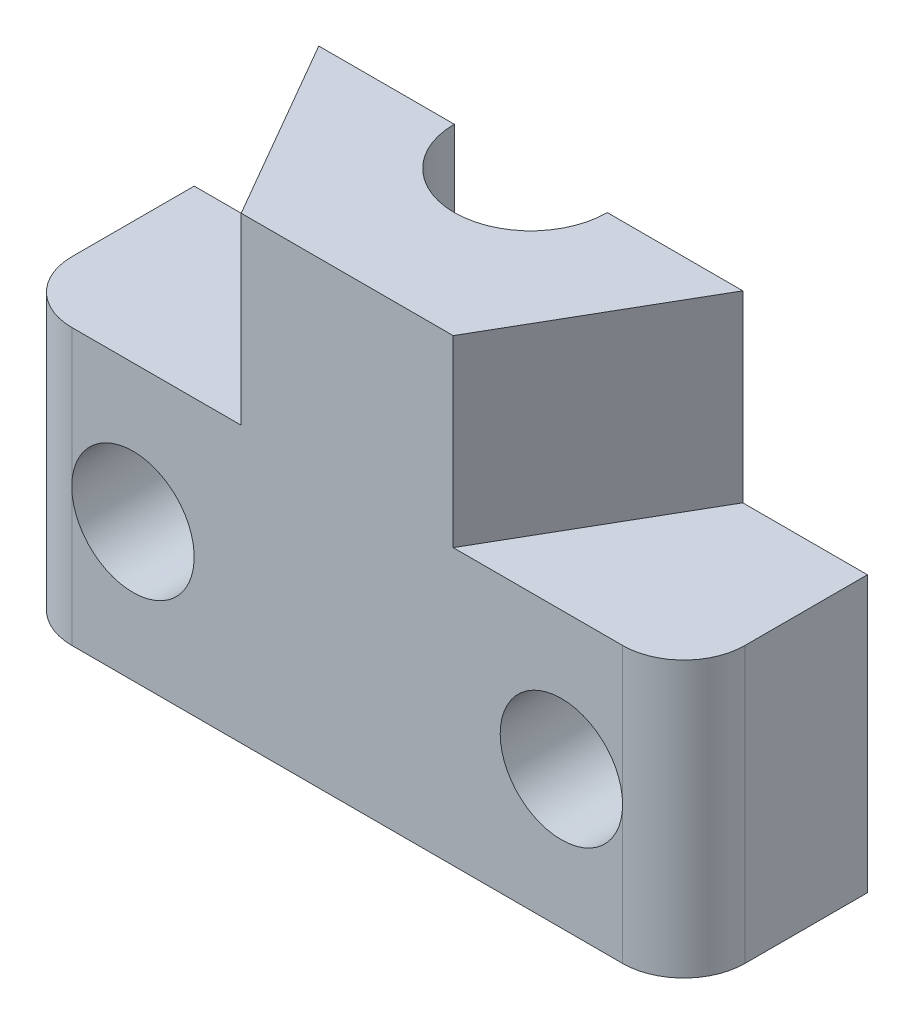
ISO-10303-21;
HEADER;
FILE_DESCRIPTION(('STEP AP214'),'2;1');
FILE_NAME('part.step','',(''),(''),'','','');
FILE_SCHEMA(('AUTOMOTIVE_DESIGN { 1 0 10303 214 1 1 1 1 }'));
ENDSEC;
DATA;
#1=APPLICATION_CONTEXT('core data for automotive mechanical design processes');
#2=APPLICATION_PROTOCOL_DEFINITION('international standard','automotive_design',2000,#1);
#3=PRODUCT_CONTEXT('',#1,'mechanical');
#4=PRODUCT('Part','Part','',(#3));
#5=PRODUCT_RELATED_PRODUCT_CATEGORY('part','',(#4));
#6=PRODUCT_DEFINITION_FORMATION('','',#4);
#7=PRODUCT_DEFINITION_CONTEXT('part definition',#1,'design');
#8=PRODUCT_DEFINITION('design','',#6,#7);
#9=PRODUCT_DEFINITION_SHAPE('','',#8);
#10=(LENGTH_UNIT() NAMED_UNIT(*) SI_UNIT(.MILLI.,.METRE.));
#11=(NAMED_UNIT(*) PLANE_ANGLE_UNIT() SI_UNIT($,.RADIAN.));
#12=(NAMED_UNIT(*) SI_UNIT($,.STERADIAN.) SOLID_ANGLE_UNIT());
#13=UNCERTAINTY_MEASURE_WITH_UNIT(LENGTH_MEASURE(1.E-05),#10,'distance_accuracy_value','');
#14=(GEOMETRIC_REPRESENTATION_CONTEXT(3) GLOBAL_UNCERTAINTY_ASSIGNED_CONTEXT((#13)) GLOBAL_UNIT_ASSIGNED_CONTEXT((#10,
#11,#12)) REPRESENTATION_CONTEXT('',''));
#15=CARTESIAN_POINT('',(0.,0.,0.));
#16=DIRECTION('',(0.,0.,1.));
#17=DIRECTION('',(1.,0.,0.));
#18=AXIS2_PLACEMENT_3D('',#15,#16,#17);
#19=CARTESIAN_POINT('',(0.,15.,0.));
#20=DIRECTION('',(0.,1.,0.));
#21=DIRECTION('',(0.,0.,1.));
#22=AXIS2_PLACEMENT_3D('',#19,#20,#21);
#23=PLANE('',#22);
#24=DIRECTION('',(0.5,0.,-0.866025403784439));
#25=VECTOR('',#24,1.);
#26=CARTESIAN_POINT('',(3.46410161513776,15.,6.00000000000001));
#27=LINE('',#26,#25);
#28=CARTESIAN_POINT('',(3.46410161513776,15.,6.00000000000001));
#29=VERTEX_POINT('',#28);
#30=CARTESIAN_POINT('',(6.92820323027551,15.,0.));
#31=VERTEX_POINT('',#30);
#32=EDGE_CURVE('E219',#29,#31,#27,.T.);
#33=ORIENTED_EDGE('',*,*,#32,.T.);
#34=DIRECTION('',(-1.,0.,0.));
#35=VECTOR('',#34,1.);
#36=CARTESIAN_POINT('',(0.,15.,0.));
#37=LINE('',#36,#35);
#38=CARTESIAN_POINT('',(2.5,15.,0.));
#39=VERTEX_POINT('',#38);
#40=EDGE_CURVE('E398',#31,#39,#37,.T.);
#41=ORIENTED_EDGE('',*,*,#40,.T.);
#42=CARTESIAN_POINT('',(0.,15.,0.));
#43=DIRECTION('',(0.,1.,0.));
#44=DIRECTION('',(0.,0.,1.));
#45=AXIS2_PLACEMENT_3D('',#42,#43,#44);
#46=CIRCLE('',#45,2.5);
#47=CARTESIAN_POINT('',(-2.5,15.,0.));
#48=VERTEX_POINT('',#47);
#49=EDGE_CURVE('E201',#48,#39,#46,.T.);
#50=ORIENTED_EDGE('',*,*,#49,.F.);
#51=CARTESIAN_POINT('',(-6.92820323027552,15.,0.));
#52=VERTEX_POINT('',#51);
#53=EDGE_CURVE('E62',#48,#52,#37,.T.);
#54=ORIENTED_EDGE('',*,*,#53,.T.);
#55=DIRECTION('',(0.5,0.,0.866025403784439));
#56=VECTOR('',#55,1.);
#57=CARTESIAN_POINT('',(-6.92820323027552,15.,0.));
#58=LINE('',#57,#56);
#59=CARTESIAN_POINT('',(-3.46410161513776,15.,6.00000000000001));
#60=VERTEX_POINT('',#59);
#61=EDGE_CURVE('E349',#52,#60,#58,.T.);
#62=ORIENTED_EDGE('',*,*,#61,.T.);
#63=DIRECTION('',(1.,0.,0.));
#64=VECTOR('',#63,1.);
#65=CARTESIAN_POINT('',(-3.46410161513776,15.,6.00000000000001));
#66=LINE('',#65,#64);
#67=EDGE_CURVE('E226',#60,#29,#66,.T.);
#68=ORIENTED_EDGE('',*,*,#67,.T.);
#69=EDGE_LOOP('',(#33,#41,#50,#54,#62,#68));
#70=FACE_BOUND('',#69,.T.);
#71=ADVANCED_FACE('F37',(#70),#23,.T.);
#72=CARTESIAN_POINT('',(0.,12.,0.));
#73=DIRECTION('',(0.,1.,0.));
#74=DIRECTION('',(0.,0.,1.));
#75=AXIS2_PLACEMENT_3D('',#72,#73,#74);
#76=PLANE('',#75);
#77=DIRECTION('',(-1.,0.,0.));
#78=VECTOR('',#77,1.);
#79=CARTESIAN_POINT('',(0.,12.,0.));
#80=LINE('',#79,#78);
#81=CARTESIAN_POINT('',(4.61880215351701,12.,0.));
#82=VERTEX_POINT('',#81);
#83=CARTESIAN_POINT('',(2.5,12.,0.));
#84=VERTEX_POINT('',#83);
#85=EDGE_CURVE('E54',#82,#84,#80,.T.);
#86=ORIENTED_EDGE('',*,*,#85,.F.);
#87=DIRECTION('',(0.5,0.,-0.866025403784439));
#88=VECTOR('',#87,1.);
#89=CARTESIAN_POINT('',(2.3094010767585,12.,4.));
#90=LINE('',#89,#88);
#91=CARTESIAN_POINT('',(2.3094010767585,12.,4.));
#92=VERTEX_POINT('',#91);
#93=EDGE_CURVE('E327',#92,#82,#90,.T.);
#94=ORIENTED_EDGE('',*,*,#93,.F.);
#95=DIRECTION('',(1.,0.,0.));
#96=VECTOR('',#95,1.);
#97=CARTESIAN_POINT('',(-2.3094010767585,12.,4.));
#98=LINE('',#97,#96);
#99=CARTESIAN_POINT('',(-2.3094010767585,12.,4.));
#100=VERTEX_POINT('',#99);
#101=EDGE_CURVE('E332',#100,#92,#98,.T.);
#102=ORIENTED_EDGE('',*,*,#101,.F.);
#103=DIRECTION('',(0.5,0.,0.866025403784439));
#104=VECTOR('',#103,1.);
#105=CARTESIAN_POINT('',(-4.61880215351701,12.,0.));
#106=LINE('',#105,#104);
#107=CARTESIAN_POINT('',(-4.61880215351701,12.,0.));
#108=VERTEX_POINT('',#107);
#109=EDGE_CURVE('E196',#108,#100,#106,.T.);
#110=ORIENTED_EDGE('',*,*,#109,.F.);
#111=CARTESIAN_POINT('',(-2.5,12.,0.));
#112=VERTEX_POINT('',#111);
#113=EDGE_CURVE('E182',#112,#108,#80,.T.);
#114=ORIENTED_EDGE('',*,*,#113,.F.);
#115=CARTESIAN_POINT('',(0.,12.,0.));
#116=DIRECTION('',(0.,1.,0.));
#117=DIRECTION('',(0.,0.,1.));
#118=AXIS2_PLACEMENT_3D('',#115,#116,#117);
#119=CIRCLE('',#118,2.5);
#120=EDGE_CURVE('E194',#84,#112,#119,.F.);
#121=ORIENTED_EDGE('',*,*,#120,.F.);
#122=EDGE_LOOP('',(#86,#94,#102,#110,#114,#121));
#123=FACE_BOUND('',#122,.T.);
#124=ADVANCED_FACE('F193',(#123),#76,.F.);
#125=CARTESIAN_POINT('',(0.,9.,0.));
#126=DIRECTION('',(0.,1.,0.));
#127=DIRECTION('',(0.,0.,1.));
#128=AXIS2_PLACEMENT_3D('',#125,#126,#127);
#129=PLANE('',#128);
#130=DIRECTION('',(-1.,0.,0.));
#131=VECTOR('',#130,1.);
#132=CARTESIAN_POINT('',(0.,9.,0.));
#133=LINE('',#132,#131);
#134=CARTESIAN_POINT('',(5.,9.,0.));
#135=VERTEX_POINT('',#134);
#136=CARTESIAN_POINT('',(4.61880215351701,9.,0.));
#137=VERTEX_POINT('',#136);
#138=EDGE_CURVE('E301',#135,#137,#133,.T.);
#139=ORIENTED_EDGE('',*,*,#138,.F.);
#140=CARTESIAN_POINT('',(0.,9.,0.));
#141=DIRECTION('',(0.,-1.,0.));
#142=DIRECTION('',(0.,0.,-1.));
#143=AXIS2_PLACEMENT_3D('',#140,#141,#142);
#144=CIRCLE('',#143,5.);
#145=CARTESIAN_POINT('',(-5.,9.,0.));
#146=VERTEX_POINT('',#145);
#147=EDGE_CURVE('E233',#135,#146,#144,.T.);
#148=ORIENTED_EDGE('',*,*,#147,.T.);
#149=CARTESIAN_POINT('',(-4.61880215351701,9.,0.));
#150=VERTEX_POINT('',#149);
#151=EDGE_CURVE('E306',#150,#146,#133,.T.);
#152=ORIENTED_EDGE('',*,*,#151,.F.);
#153=DIRECTION('',(0.5,0.,0.866025403784439));
#154=VECTOR('',#153,1.);
#155=CARTESIAN_POINT('',(-4.61880215351701,9.,0.));
#156=LINE('',#155,#154);
#157=CARTESIAN_POINT('',(-2.3094010767585,9.,4.));
#158=VERTEX_POINT('',#157);
#159=EDGE_CURVE('E203',#150,#158,#156,.T.);
#160=ORIENTED_EDGE('',*,*,#159,.T.);
#161=DIRECTION('',(1.,0.,0.));
#162=VECTOR('',#161,1.);
#163=CARTESIAN_POINT('',(-2.3094010767585,9.,4.));
#164=LINE('',#163,#162);
#165=CARTESIAN_POINT('',(2.3094010767585,9.,4.));
#166=VERTEX_POINT('',#165);
#167=EDGE_CURVE('E330',#158,#166,#164,.T.);
#168=ORIENTED_EDGE('',*,*,#167,.T.);
#169=DIRECTION('',(0.5,0.,-0.866025403784439));
#170=VECTOR('',#169,1.);
#171=CARTESIAN_POINT('',(2.3094010767585,9.,4.));
#172=LINE('',#171,#170);
#173=EDGE_CURVE('E200',#166,#137,#172,.T.);
#174=ORIENTED_EDGE('',*,*,#173,.T.);
#175=EDGE_LOOP('',(#139,#148,#152,#160,#168,#174));
#176=FACE_BOUND('',#175,.T.);
#177=ADVANCED_FACE('F437',(#176),#129,.F.);
#178=CARTESIAN_POINT('',(0.,9.,0.));
#179=DIRECTION('',(0.,-1.,0.));
#180=DIRECTION('',(0.,0.,-1.));
#181=AXIS2_PLACEMENT_3D('',#178,#179,#180);
#182=PLANE('',#181);
#183=DIRECTION('',(1.,0.,0.));
#184=VECTOR('',#183,1.);
#185=CARTESIAN_POINT('',(0.,9.,0.));
#186=LINE('',#185,#184);
#187=CARTESIAN_POINT('',(-11.,9.,0.));
#188=VERTEX_POINT('',#187);
#189=CARTESIAN_POINT('',(-6.92820323027552,9.,0.));
#190=VERTEX_POINT('',#189);
#191=EDGE_CURVE('E321',#188,#190,#186,.T.);
#192=ORIENTED_EDGE('',*,*,#191,.F.);
#193=DIRECTION('',(0.,0.,1.));
#194=VECTOR('',#193,1.);
#195=CARTESIAN_POINT('',(-11.,9.,6.));
#196=LINE('',#195,#194);
#197=CARTESIAN_POINT('',(-11.,9.,4.));
#198=VERTEX_POINT('',#197);
#199=EDGE_CURVE('E246',#188,#198,#196,.T.);
#200=ORIENTED_EDGE('',*,*,#199,.T.);
#201=CARTESIAN_POINT('',(-9.,9.,4.));
#202=DIRECTION('',(0.,-1.,0.));
#203=DIRECTION('',(0.,0.,-1.));
#204=AXIS2_PLACEMENT_3D('',#201,#202,#203);
#205=CIRCLE('',#204,2.);
#206=CARTESIAN_POINT('',(-9.,9.,6.));
#207=VERTEX_POINT('',#206);
#208=EDGE_CURVE('E271',#198,#207,#205,.F.);
#209=ORIENTED_EDGE('',*,*,#208,.T.);
#210=DIRECTION('',(1.,0.,0.));
#211=VECTOR('',#210,1.);
#212=CARTESIAN_POINT('',(-11.,9.,6.));
#213=LINE('',#212,#211);
#214=CARTESIAN_POINT('',(-3.46410161513776,9.,6.));
#215=VERTEX_POINT('',#214);
#216=EDGE_CURVE('E257',#207,#215,#213,.T.);
#217=ORIENTED_EDGE('',*,*,#216,.T.);
#218=DIRECTION('',(0.5,0.,0.866025403784439));
#219=VECTOR('',#218,1.);
#220=CARTESIAN_POINT('',(-6.92820323027552,9.,0.));
#221=LINE('',#220,#219);
#222=EDGE_CURVE('E215',#190,#215,#221,.T.);
#223=ORIENTED_EDGE('',*,*,#222,.F.);
#224=EDGE_LOOP('',(#192,#200,#209,#217,#223));
#225=FACE_BOUND('',#224,.T.);
#226=ADVANCED_FACE('F387',(#225),#182,.F.);
#227=DIRECTION('',(1.,0.,0.));
#228=VECTOR('',#227,1.);
#229=CARTESIAN_POINT('',(0.,9.,0.));
#230=LINE('',#229,#228);
#231=CARTESIAN_POINT('',(6.92820323027551,9.,0.));
#232=VERTEX_POINT('',#231);
#233=CARTESIAN_POINT('',(11.,9.,0.));
#234=VERTEX_POINT('',#233);
#235=EDGE_CURVE('E369',#232,#234,#230,.T.);
#236=ORIENTED_EDGE('',*,*,#235,.F.);
#237=DIRECTION('',(0.5,0.,-0.866025403784439));
#238=VECTOR('',#237,1.);
#239=CARTESIAN_POINT('',(3.46410161513776,9.,6.00000000000001));
#240=LINE('',#239,#238);
#241=CARTESIAN_POINT('',(3.46410161513776,9.,6.));
#242=VERTEX_POINT('',#241);
#243=EDGE_CURVE('E220',#242,#232,#240,.T.);
#244=ORIENTED_EDGE('',*,*,#243,.F.);
#245=CARTESIAN_POINT('',(9.,9.,6.));
#246=VERTEX_POINT('',#245);
#247=EDGE_CURVE('E249',#242,#246,#213,.T.);
#248=ORIENTED_EDGE('',*,*,#247,.T.);
#249=CARTESIAN_POINT('',(9.,9.,4.));
#250=DIRECTION('',(0.,-1.,0.));
#251=DIRECTION('',(0.,0.,-1.));
#252=AXIS2_PLACEMENT_3D('',#249,#250,#251);
#253=CIRCLE('',#252,2.);
#254=CARTESIAN_POINT('',(11.,9.,4.));
#255=VERTEX_POINT('',#254);
#256=EDGE_CURVE('E269',#246,#255,#253,.F.);
#257=ORIENTED_EDGE('',*,*,#256,.T.);
#258=DIRECTION('',(0.,0.,-1.));
#259=VECTOR('',#258,1.);
#260=CARTESIAN_POINT('',(11.,9.,6.));
#261=LINE('',#260,#259);
#262=EDGE_CURVE('E243',#255,#234,#261,.T.);
#263=ORIENTED_EDGE('',*,*,#262,.T.);
#264=EDGE_LOOP('',(#236,#244,#248,#257,#263));
#265=FACE_BOUND('',#264,.T.);
#266=ADVANCED_FACE('F367',(#265),#182,.F.);
#267=CARTESIAN_POINT('',(0.,0.,0.));
#268=DIRECTION('',(0.,-1.,0.));
#269=DIRECTION('',(0.,0.,-1.));
#270=AXIS2_PLACEMENT_3D('',#267,#268,#269);
#271=PLANE('',#270);
#272=DIRECTION('',(0.,0.,1.));
#273=VECTOR('',#272,1.);
#274=CARTESIAN_POINT('',(-11.,0.,6.));
#275=LINE('',#274,#273);
#276=CARTESIAN_POINT('',(-11.,0.,0.));
#277=VERTEX_POINT('',#276);
#278=CARTESIAN_POINT('',(-11.,0.,4.));
#279=VERTEX_POINT('',#278);
#280=EDGE_CURVE('E281',#277,#279,#275,.T.);
#281=ORIENTED_EDGE('',*,*,#280,.F.);
#282=DIRECTION('',(1.,0.,0.));
#283=VECTOR('',#282,1.);
#284=CARTESIAN_POINT('',(0.,0.,0.));
#285=LINE('',#284,#283);
#286=CARTESIAN_POINT('',(-3.6,0.,0.));
#287=VERTEX_POINT('',#286);
#288=EDGE_CURVE('E304',#277,#287,#285,.T.);
#289=ORIENTED_EDGE('',*,*,#288,.T.);
#290=CARTESIAN_POINT('',(0.,0.,0.));
#291=DIRECTION('',(0.,1.,0.));
#292=DIRECTION('',(0.,0.,1.));
#293=AXIS2_PLACEMENT_3D('',#290,#291,#292);
#294=CIRCLE('',#293,3.6);
#295=CARTESIAN_POINT('',(3.6,0.,0.));
#296=VERTEX_POINT('',#295);
#297=EDGE_CURVE('E239',#287,#296,#294,.T.);
#298=ORIENTED_EDGE('',*,*,#297,.T.);
#299=CARTESIAN_POINT('',(11.,0.,0.));
#300=VERTEX_POINT('',#299);
#301=EDGE_CURVE('E297',#296,#300,#285,.T.);
#302=ORIENTED_EDGE('',*,*,#301,.T.);
#303=DIRECTION('',(0.,0.,-1.));
#304=VECTOR('',#303,1.);
#305=CARTESIAN_POINT('',(11.,0.,6.));
#306=LINE('',#305,#304);
#307=CARTESIAN_POINT('',(11.,0.,4.));
#308=VERTEX_POINT('',#307);
#309=EDGE_CURVE('E242',#308,#300,#306,.T.);
#310=ORIENTED_EDGE('',*,*,#309,.F.);
#311=CARTESIAN_POINT('',(9.,0.,4.));
#312=DIRECTION('',(0.,-1.,0.));
#313=DIRECTION('',(0.,0.,-1.));
#314=AXIS2_PLACEMENT_3D('',#311,#312,#313);
#315=CIRCLE('',#314,2.);
#316=CARTESIAN_POINT('',(9.,0.,6.));
#317=VERTEX_POINT('',#316);
#318=EDGE_CURVE('E273',#308,#317,#315,.T.);
#319=ORIENTED_EDGE('',*,*,#318,.T.);
#320=DIRECTION('',(1.,0.,0.));
#321=VECTOR('',#320,1.);
#322=CARTESIAN_POINT('',(-11.,0.,6.));
#323=LINE('',#322,#321);
#324=CARTESIAN_POINT('',(-9.,0.,6.));
#325=VERTEX_POINT('',#324);
#326=EDGE_CURVE('E247',#325,#317,#323,.T.);
#327=ORIENTED_EDGE('',*,*,#326,.F.);
#328=CARTESIAN_POINT('',(-9.,0.,4.));
#329=DIRECTION('',(0.,-1.,0.));
#330=DIRECTION('',(0.,0.,-1.));
#331=AXIS2_PLACEMENT_3D('',#328,#329,#330);
#332=CIRCLE('',#331,2.);
#333=EDGE_CURVE('E275',#325,#279,#332,.T.);
#334=ORIENTED_EDGE('',*,*,#333,.T.);
#335=EDGE_LOOP('',(#281,#289,#298,#302,#310,#319,#327,#334));
#336=FACE_BOUND('',#335,.T.);
#337=ADVANCED_FACE('F295',(#336),#271,.T.);
#338=CARTESIAN_POINT('',(11.,9.,6.));
#339=DIRECTION('',(-1.,0.,0.));
#340=DIRECTION('',(0.,0.,1.));
#341=AXIS2_PLACEMENT_3D('',#338,#339,#340);
#342=PLANE('',#341);
#343=DIRECTION('',(0.,-1.,0.));
#344=VECTOR('',#343,1.);
#345=CARTESIAN_POINT('',(11.,9.,0.));
#346=LINE('',#345,#344);
#347=EDGE_CURVE('E291',#234,#300,#346,.T.);
#348=ORIENTED_EDGE('',*,*,#347,.F.);
#349=ORIENTED_EDGE('',*,*,#262,.F.);
#350=DIRECTION('',(0.,-1.,0.));
#351=VECTOR('',#350,1.);
#352=CARTESIAN_POINT('',(11.,9.,4.));
#353=LINE('',#352,#351);
#354=EDGE_CURVE('E266',#255,#308,#353,.T.);
#355=ORIENTED_EDGE('',*,*,#354,.T.);
#356=ORIENTED_EDGE('',*,*,#309,.T.);
#357=EDGE_LOOP('',(#348,#349,#355,#356));
#358=FACE_BOUND('',#357,.T.);
#359=ADVANCED_FACE('F289',(#358),#342,.F.);
#360=CARTESIAN_POINT('',(-11.,9.,6.));
#361=DIRECTION('',(1.,0.,0.));
#362=DIRECTION('',(0.,0.,-1.));
#363=AXIS2_PLACEMENT_3D('',#360,#361,#362);
#364=PLANE('',#363);
#365=DIRECTION('',(0.,1.,0.));
#366=VECTOR('',#365,1.);
#367=CARTESIAN_POINT('',(-11.,9.,0.));
#368=LINE('',#367,#366);
#369=EDGE_CURVE('E310',#277,#188,#368,.T.);
#370=ORIENTED_EDGE('',*,*,#369,.F.);
#371=ORIENTED_EDGE('',*,*,#280,.T.);
#372=DIRECTION('',(0.,-1.,0.));
#373=VECTOR('',#372,1.);
#374=CARTESIAN_POINT('',(-11.,9.,4.));
#375=LINE('',#374,#373);
#376=EDGE_CURVE('E259',#279,#198,#375,.F.);
#377=ORIENTED_EDGE('',*,*,#376,.T.);
#378=ORIENTED_EDGE('',*,*,#199,.F.);
#379=EDGE_LOOP('',(#370,#371,#377,#378));
#380=FACE_BOUND('',#379,.T.);
#381=ADVANCED_FACE('F384',(#380),#364,.F.);
#382=CARTESIAN_POINT('',(0.,8.,0.));
#383=DIRECTION('',(0.,-1.,0.));
#384=DIRECTION('',(0.,0.,-1.));
#385=AXIS2_PLACEMENT_3D('',#382,#383,#384);
#386=CYLINDRICAL_SURFACE('',#385,3.6);
#387=CARTESIAN_POINT('',(0.,7.,0.));
#388=DIRECTION('',(0.,-1.,0.));
#389=DIRECTION('',(0.,0.,-1.));
#390=AXIS2_PLACEMENT_3D('',#387,#388,#389);
#391=CIRCLE('',#390,3.6);
#392=CARTESIAN_POINT('',(3.6,7.,0.));
#393=VERTEX_POINT('',#392);
#394=CARTESIAN_POINT('',(-3.6,7.,0.));
#395=VERTEX_POINT('',#394);
#396=EDGE_CURVE('E236',#393,#395,#391,.T.);
#397=ORIENTED_EDGE('',*,*,#396,.F.);
#398=DIRECTION('',(0.,-1.,0.));
#399=VECTOR('',#398,1.);
#400=CARTESIAN_POINT('',(3.6,8.,0.));
#401=LINE('',#400,#399);
#402=EDGE_CURVE('E302',#393,#296,#401,.T.);
#403=ORIENTED_EDGE('',*,*,#402,.T.);
#404=ORIENTED_EDGE('',*,*,#297,.F.);
#405=DIRECTION('',(0.,-1.,0.));
#406=VECTOR('',#405,1.);
#407=CARTESIAN_POINT('',(-3.6,8.,0.));
#408=LINE('',#407,#406);
#409=EDGE_CURVE('E309',#287,#395,#408,.F.);
#410=ORIENTED_EDGE('',*,*,#409,.T.);
#411=EDGE_LOOP('',(#397,#403,#404,#410));
#412=FACE_BOUND('',#411,.T.);
#413=ADVANCED_FACE('F456',(#412),#386,.F.);
#414=CARTESIAN_POINT('',(0.,9.,0.));
#415=DIRECTION('',(0.,-1.,0.));
#416=DIRECTION('',(0.,0.,-1.));
#417=AXIS2_PLACEMENT_3D('',#414,#415,#416);
#418=CYLINDRICAL_SURFACE('',#417,5.);
#419=DIRECTION('',(0.,-1.,0.));
#420=VECTOR('',#419,1.);
#421=CARTESIAN_POINT('',(5.,9.,0.));
#422=LINE('',#421,#420);
#423=CARTESIAN_POINT('',(5.,7.,0.));
#424=VERTEX_POINT('',#423);
#425=EDGE_CURVE('E307',#424,#135,#422,.F.);
#426=ORIENTED_EDGE('',*,*,#425,.F.);
#427=CARTESIAN_POINT('',(0.,7.,0.));
#428=DIRECTION('',(0.,-1.,0.));
#429=DIRECTION('',(0.,0.,-1.));
#430=AXIS2_PLACEMENT_3D('',#427,#428,#429);
#431=CIRCLE('',#430,5.);
#432=CARTESIAN_POINT('',(-5.,7.,0.));
#433=VERTEX_POINT('',#432);
#434=EDGE_CURVE('E232',#424,#433,#431,.T.);
#435=ORIENTED_EDGE('',*,*,#434,.T.);
#436=DIRECTION('',(0.,-1.,0.));
#437=VECTOR('',#436,1.);
#438=CARTESIAN_POINT('',(-5.,9.,0.));
#439=LINE('',#438,#437);
#440=EDGE_CURVE('E312',#146,#433,#439,.T.);
#441=ORIENTED_EDGE('',*,*,#440,.F.);
#442=ORIENTED_EDGE('',*,*,#147,.F.);
#443=EDGE_LOOP('',(#426,#435,#441,#442));
#444=FACE_BOUND('',#443,.T.);
#445=ADVANCED_FACE('F453',(#444),#418,.F.);
#446=CARTESIAN_POINT('',(0.,7.,0.));
#447=DIRECTION('',(0.,-1.,0.));
#448=DIRECTION('',(0.,0.,-1.));
#449=AXIS2_PLACEMENT_3D('',#446,#447,#448);
#450=PLANE('',#449);
#451=DIRECTION('',(1.,0.,0.));
#452=VECTOR('',#451,1.);
#453=CARTESIAN_POINT('',(0.,7.,0.));
#454=LINE('',#453,#452);
#455=EDGE_CURVE('E316',#433,#395,#454,.T.);
#456=ORIENTED_EDGE('',*,*,#455,.F.);
#457=ORIENTED_EDGE('',*,*,#434,.F.);
#458=EDGE_CURVE('E395',#393,#424,#454,.T.);
#459=ORIENTED_EDGE('',*,*,#458,.F.);
#460=ORIENTED_EDGE('',*,*,#396,.T.);
#461=EDGE_LOOP('',(#456,#457,#459,#460));
#462=FACE_BOUND('',#461,.T.);
#463=ADVANCED_FACE('F450',(#462),#450,.F.);
#464=CARTESIAN_POINT('',(0.,22.0710678118655,0.));
#465=DIRECTION('',(0.,-1.,0.));
#466=DIRECTION('',(0.,0.,-1.));
#467=AXIS2_PLACEMENT_3D('',#464,#465,#466);
#468=CYLINDRICAL_SURFACE('',#467,2.5);
#469=ORIENTED_EDGE('',*,*,#49,.T.);
#470=DIRECTION('',(0.,-1.,0.));
#471=VECTOR('',#470,1.);
#472=CARTESIAN_POINT('',(2.5,22.0710678118655,0.));
#473=LINE('',#472,#471);
#474=EDGE_CURVE('E199',#39,#84,#473,.T.);
#475=ORIENTED_EDGE('',*,*,#474,.T.);
#476=ORIENTED_EDGE('',*,*,#120,.T.);
#477=DIRECTION('',(0.,-1.,0.));
#478=VECTOR('',#477,1.);
#479=CARTESIAN_POINT('',(-2.5,22.0710678118655,0.));
#480=LINE('',#479,#478);
#481=EDGE_CURVE('E179',#112,#48,#480,.F.);
#482=ORIENTED_EDGE('',*,*,#481,.T.);
#483=EDGE_LOOP('',(#469,#475,#476,#482));
#484=FACE_BOUND('',#483,.T.);
#485=ADVANCED_FACE('F198',(#484),#468,.F.);
#486=CARTESIAN_POINT('',(-7.,4.5,6.00005));
#487=DIRECTION('',(0.,0.,-1.));
#488=DIRECTION('',(-1.,0.,0.));
#489=AXIS2_PLACEMENT_3D('',#486,#487,#488);
#490=CYLINDRICAL_SURFACE('',#489,2.);
#491=CARTESIAN_POINT('',(-7.,4.5,6.));
#492=DIRECTION('',(0.,0.,-1.));
#493=DIRECTION('',(-1.,0.,0.));
#494=AXIS2_PLACEMENT_3D('',#491,#492,#493);
#495=CIRCLE('',#494,2.);
#496=CARTESIAN_POINT('',(-9.,4.5,6.));
#497=VERTEX_POINT('',#496);
#498=EDGE_CURVE('E205',#497,#497,#495,.T.);
#499=ORIENTED_EDGE('',*,*,#498,.F.);
#500=EDGE_LOOP('',(#499));
#501=FACE_BOUND('',#500,.T.);
#502=CARTESIAN_POINT('',(-7.,4.5,0.));
#503=DIRECTION('',(0.,0.,-1.));
#504=DIRECTION('',(-1.,0.,0.));
#505=AXIS2_PLACEMENT_3D('',#502,#503,#504);
#506=CIRCLE('',#505,2.);
#507=CARTESIAN_POINT('',(-9.,4.5,0.));
#508=VERTEX_POINT('',#507);
#509=EDGE_CURVE('E188',#508,#508,#506,.F.);
#510=ORIENTED_EDGE('',*,*,#509,.F.);
#511=EDGE_LOOP('',(#510));
#512=FACE_BOUND('',#511,.T.);
#513=ADVANCED_FACE('F406',(#501,#512),#490,.F.);
#514=CARTESIAN_POINT('',(7.,4.5,6.00005));
#515=DIRECTION('',(0.,0.,-1.));
#516=DIRECTION('',(-1.,0.,0.));
#517=AXIS2_PLACEMENT_3D('',#514,#515,#516);
#518=CYLINDRICAL_SURFACE('',#517,2.);
#519=CARTESIAN_POINT('',(7.,4.5,6.));
#520=DIRECTION('',(0.,0.,-1.));
#521=DIRECTION('',(-1.,0.,0.));
#522=AXIS2_PLACEMENT_3D('',#519,#520,#521);
#523=CIRCLE('',#522,2.);
#524=CARTESIAN_POINT('',(9.,4.5,6.));
#525=VERTEX_POINT('',#524);
#526=EDGE_CURVE('E323',#525,#525,#523,.F.);
#527=ORIENTED_EDGE('',*,*,#526,.T.);
#528=EDGE_LOOP('',(#527));
#529=FACE_BOUND('',#528,.T.);
#530=CARTESIAN_POINT('',(7.,4.5,0.));
#531=DIRECTION('',(0.,0.,-1.));
#532=DIRECTION('',(-1.,0.,0.));
#533=AXIS2_PLACEMENT_3D('',#530,#531,#532);
#534=CIRCLE('',#533,2.);
#535=CARTESIAN_POINT('',(5.,4.5,0.));
#536=VERTEX_POINT('',#535);
#537=EDGE_CURVE('E41',#536,#536,#534,.T.);
#538=ORIENTED_EDGE('',*,*,#537,.T.);
#539=EDGE_LOOP('',(#538));
#540=FACE_BOUND('',#539,.T.);
#541=ADVANCED_FACE('F409',(#529,#540),#518,.F.);
#542=CARTESIAN_POINT('',(-11.,9.,6.));
#543=DIRECTION('',(0.,0.,-1.));
#544=DIRECTION('',(-1.,0.,0.));
#545=AXIS2_PLACEMENT_3D('',#542,#543,#544);
#546=PLANE('',#545);
#547=DIRECTION('',(0.,-1.,0.));
#548=VECTOR('',#547,1.);
#549=CARTESIAN_POINT('',(9.,9.,6.));
#550=LINE('',#549,#548);
#551=EDGE_CURVE('E11',#317,#525,#550,.F.);
#552=ORIENTED_EDGE('',*,*,#551,.T.);
#553=ORIENTED_EDGE('',*,*,#526,.F.);
#554=EDGE_CURVE('E46',#525,#246,#550,.F.);
#555=ORIENTED_EDGE('',*,*,#554,.T.);
#556=ORIENTED_EDGE('',*,*,#247,.F.);
#557=DIRECTION('',(0.,-1.,0.));
#558=VECTOR('',#557,1.);
#559=CARTESIAN_POINT('',(3.46410161513776,15.,6.00000000000001));
#560=LINE('',#559,#558);
#561=EDGE_CURVE('E214',#29,#242,#560,.T.);
#562=ORIENTED_EDGE('',*,*,#561,.F.);
#563=ORIENTED_EDGE('',*,*,#67,.F.);
#564=DIRECTION('',(0.,-1.,0.));
#565=VECTOR('',#564,1.);
#566=CARTESIAN_POINT('',(-3.46410161513776,15.,6.00000000000001));
#567=LINE('',#566,#565);
#568=EDGE_CURVE('E210',#60,#215,#567,.T.);
#569=ORIENTED_EDGE('',*,*,#568,.T.);
#570=ORIENTED_EDGE('',*,*,#216,.F.);
#571=DIRECTION('',(0.,-1.,0.));
#572=VECTOR('',#571,1.);
#573=CARTESIAN_POINT('',(-9.,9.,6.));
#574=LINE('',#573,#572);
#575=EDGE_CURVE('E262',#207,#497,#574,.T.);
#576=ORIENTED_EDGE('',*,*,#575,.T.);
#577=ORIENTED_EDGE('',*,*,#498,.T.);
#578=EDGE_CURVE('E265',#497,#325,#574,.T.);
#579=ORIENTED_EDGE('',*,*,#578,.T.);
#580=ORIENTED_EDGE('',*,*,#326,.T.);
#581=EDGE_LOOP('',(#552,#553,#555,#556,#562,#563,#569,#570,#576,#577,#579,#580));
#582=FACE_BOUND('',#581,.T.);
#583=ADVANCED_FACE('F371',(#582),#546,.F.);
#584=CARTESIAN_POINT('',(9.,9.,4.));
#585=DIRECTION('',(0.,-1.,0.));
#586=DIRECTION('',(0.,0.,-1.));
#587=AXIS2_PLACEMENT_3D('',#584,#585,#586);
#588=CYLINDRICAL_SURFACE('',#587,2.);
#589=ORIENTED_EDGE('',*,*,#256,.F.);
#590=ORIENTED_EDGE('',*,*,#554,.F.);
#591=ORIENTED_EDGE('',*,*,#551,.F.);
#592=ORIENTED_EDGE('',*,*,#318,.F.);
#593=ORIENTED_EDGE('',*,*,#354,.F.);
#594=EDGE_LOOP('',(#589,#590,#591,#592,#593));
#595=FACE_BOUND('',#594,.T.);
#596=ADVANCED_FACE('F376',(#595),#588,.T.);
#597=CARTESIAN_POINT('',(-9.,9.,4.));
#598=DIRECTION('',(0.,-1.,0.));
#599=DIRECTION('',(0.,0.,-1.));
#600=AXIS2_PLACEMENT_3D('',#597,#598,#599);
#601=CYLINDRICAL_SURFACE('',#600,2.);
#602=ORIENTED_EDGE('',*,*,#208,.F.);
#603=ORIENTED_EDGE('',*,*,#376,.F.);
#604=ORIENTED_EDGE('',*,*,#333,.F.);
#605=ORIENTED_EDGE('',*,*,#578,.F.);
#606=ORIENTED_EDGE('',*,*,#575,.F.);
#607=EDGE_LOOP('',(#602,#603,#604,#605,#606));
#608=FACE_BOUND('',#607,.T.);
#609=ADVANCED_FACE('F39',(#608),#601,.T.);
#610=CARTESIAN_POINT('',(-6.92820323027552,15.,0.));
#611=DIRECTION('',(0.866025403784439,0.,-0.5));
#612=DIRECTION('',(-0.5,0.,-0.866025403784439));
#613=AXIS2_PLACEMENT_3D('',#610,#611,#612);
#614=PLANE('',#613);
#615=ORIENTED_EDGE('',*,*,#222,.T.);
#616=ORIENTED_EDGE('',*,*,#568,.F.);
#617=ORIENTED_EDGE('',*,*,#61,.F.);
#618=DIRECTION('',(0.,-1.,0.));
#619=VECTOR('',#618,1.);
#620=CARTESIAN_POINT('',(-6.92820323027552,15.,0.));
#621=LINE('',#620,#619);
#622=EDGE_CURVE('E213',#52,#190,#621,.T.);
#623=ORIENTED_EDGE('',*,*,#622,.T.);
#624=EDGE_LOOP('',(#615,#616,#617,#623));
#625=FACE_BOUND('',#624,.T.);
#626=ADVANCED_FACE('F404',(#625),#614,.F.);
#627=CARTESIAN_POINT('',(3.46410161513776,15.,6.00000000000001));
#628=DIRECTION('',(-0.866025403784439,0.,-0.5));
#629=DIRECTION('',(-0.5,0.,0.866025403784439));
#630=AXIS2_PLACEMENT_3D('',#627,#628,#629);
#631=PLANE('',#630);
#632=ORIENTED_EDGE('',*,*,#243,.T.);
#633=DIRECTION('',(0.,-1.,0.));
#634=VECTOR('',#633,1.);
#635=CARTESIAN_POINT('',(6.92820323027551,15.,0.));
#636=LINE('',#635,#634);
#637=EDGE_CURVE('E230',#31,#232,#636,.T.);
#638=ORIENTED_EDGE('',*,*,#637,.F.);
#639=ORIENTED_EDGE('',*,*,#32,.F.);
#640=ORIENTED_EDGE('',*,*,#561,.T.);
#641=EDGE_LOOP('',(#632,#638,#639,#640));
#642=FACE_BOUND('',#641,.T.);
#643=ADVANCED_FACE('F362',(#642),#631,.F.);
#644=CARTESIAN_POINT('',(2.3094010767585,12.,4.));
#645=DIRECTION('',(-0.866025403784439,0.,-0.5));
#646=DIRECTION('',(-0.5,0.,0.866025403784439));
#647=AXIS2_PLACEMENT_3D('',#644,#645,#646);
#648=PLANE('',#647);
#649=ORIENTED_EDGE('',*,*,#173,.F.);
#650=DIRECTION('',(0.,-1.,0.));
#651=VECTOR('',#650,1.);
#652=CARTESIAN_POINT('',(2.3094010767585,12.,4.));
#653=LINE('',#652,#651);
#654=EDGE_CURVE('E333',#92,#166,#653,.T.);
#655=ORIENTED_EDGE('',*,*,#654,.F.);
#656=ORIENTED_EDGE('',*,*,#93,.T.);
#657=DIRECTION('',(0.,-1.,0.));
#658=VECTOR('',#657,1.);
#659=CARTESIAN_POINT('',(4.61880215351701,12.,0.));
#660=LINE('',#659,#658);
#661=EDGE_CURVE('E345',#82,#137,#660,.T.);
#662=ORIENTED_EDGE('',*,*,#661,.T.);
#663=EDGE_LOOP('',(#649,#655,#656,#662));
#664=FACE_BOUND('',#663,.T.);
#665=ADVANCED_FACE('F441',(#664),#648,.T.);
#666=CARTESIAN_POINT('',(-4.61880215351701,12.,0.));
#667=DIRECTION('',(0.866025403784438,0.,-0.5));
#668=DIRECTION('',(-0.5,0.,-0.866025403784439));
#669=AXIS2_PLACEMENT_3D('',#666,#667,#668);
#670=PLANE('',#669);
#671=ORIENTED_EDGE('',*,*,#159,.F.);
#672=DIRECTION('',(0.,-1.,0.));
#673=VECTOR('',#672,1.);
#674=CARTESIAN_POINT('',(-4.61880215351701,12.,0.));
#675=LINE('',#674,#673);
#676=EDGE_CURVE('E343',#108,#150,#675,.T.);
#677=ORIENTED_EDGE('',*,*,#676,.F.);
#678=ORIENTED_EDGE('',*,*,#109,.T.);
#679=DIRECTION('',(0.,-1.,0.));
#680=VECTOR('',#679,1.);
#681=CARTESIAN_POINT('',(-2.3094010767585,12.,4.));
#682=LINE('',#681,#680);
#683=EDGE_CURVE('E341',#100,#158,#682,.T.);
#684=ORIENTED_EDGE('',*,*,#683,.T.);
#685=EDGE_LOOP('',(#671,#677,#678,#684));
#686=FACE_BOUND('',#685,.T.);
#687=ADVANCED_FACE('F428',(#686),#670,.T.);
#688=CARTESIAN_POINT('',(-2.3094010767585,12.,4.));
#689=DIRECTION('',(0.,0.,-1.));
#690=DIRECTION('',(-1.,0.,0.));
#691=AXIS2_PLACEMENT_3D('',#688,#689,#690);
#692=PLANE('',#691);
#693=ORIENTED_EDGE('',*,*,#167,.F.);
#694=ORIENTED_EDGE('',*,*,#683,.F.);
#695=ORIENTED_EDGE('',*,*,#101,.T.);
#696=ORIENTED_EDGE('',*,*,#654,.T.);
#697=EDGE_LOOP('',(#693,#694,#695,#696));
#698=FACE_BOUND('',#697,.T.);
#699=ADVANCED_FACE('F421',(#698),#692,.T.);
#700=CARTESIAN_POINT('',(0.,0.,0.));
#701=DIRECTION('',(0.,0.,-1.));
#702=DIRECTION('',(-1.,0.,0.));
#703=AXIS2_PLACEMENT_3D('',#700,#701,#702);
#704=PLANE('',#703);
#705=ORIENTED_EDGE('',*,*,#537,.F.);
#706=EDGE_LOOP('',(#705));
#707=FACE_BOUND('',#706,.T.);
#708=ORIENTED_EDGE('',*,*,#235,.T.);
#709=ORIENTED_EDGE('',*,*,#347,.T.);
#710=ORIENTED_EDGE('',*,*,#301,.F.);
#711=ORIENTED_EDGE('',*,*,#402,.F.);
#712=ORIENTED_EDGE('',*,*,#458,.T.);
#713=ORIENTED_EDGE('',*,*,#425,.T.);
#714=ORIENTED_EDGE('',*,*,#138,.T.);
#715=ORIENTED_EDGE('',*,*,#661,.F.);
#716=ORIENTED_EDGE('',*,*,#85,.T.);
#717=ORIENTED_EDGE('',*,*,#474,.F.);
#718=ORIENTED_EDGE('',*,*,#40,.F.);
#719=ORIENTED_EDGE('',*,*,#637,.T.);
#720=EDGE_LOOP('',(#708,#709,#710,#711,#712,#713,#714,#715,#716,#717,#718,#719));
#721=FACE_BOUND('',#720,.T.);
#722=ADVANCED_FACE('F419',(#707,#721),#704,.T.);
#723=ORIENTED_EDGE('',*,*,#509,.T.);
#724=EDGE_LOOP('',(#723));
#725=FACE_BOUND('',#724,.T.);
#726=ORIENTED_EDGE('',*,*,#191,.T.);
#727=ORIENTED_EDGE('',*,*,#622,.F.);
#728=ORIENTED_EDGE('',*,*,#53,.F.);
#729=ORIENTED_EDGE('',*,*,#481,.F.);
#730=ORIENTED_EDGE('',*,*,#113,.T.);
#731=ORIENTED_EDGE('',*,*,#676,.T.);
#732=ORIENTED_EDGE('',*,*,#151,.T.);
#733=ORIENTED_EDGE('',*,*,#440,.T.);
#734=ORIENTED_EDGE('',*,*,#455,.T.);
#735=ORIENTED_EDGE('',*,*,#409,.F.);
#736=ORIENTED_EDGE('',*,*,#288,.F.);
#737=ORIENTED_EDGE('',*,*,#369,.T.);
#738=EDGE_LOOP('',(#726,#727,#728,#729,#730,#731,#732,#733,#734,#735,#736,#737));
#739=FACE_BOUND('',#738,.T.);
#740=ADVANCED_FACE('F181',(#725,#739),#704,.T.);
#741=CLOSED_SHELL('',(#71,#124,#177,#226,#266,#337,#359,#381,#413,#445,#463,#485,#513,#541,#583,
#596,#609,#626,#643,#665,#687,#699,#722,#740));
#742=MANIFOLD_SOLID_BREP('B2',#741);
#743=ADVANCED_BREP_SHAPE_REPRESENTATION('',(#18,#742),#14);
#744=SHAPE_DEFINITION_REPRESENTATION(#9,#743);
ENDSEC;
END-ISO-10303-21;
